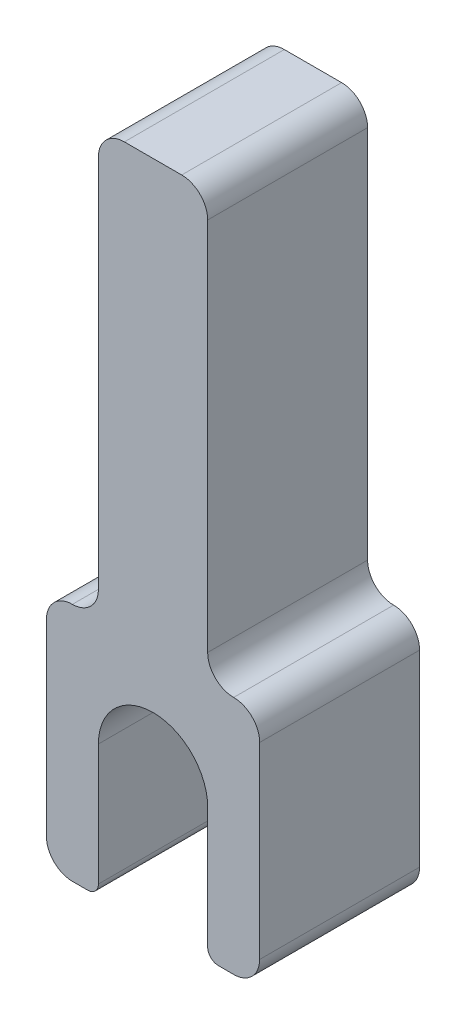
ISO-10303-21;
HEADER;
FILE_DESCRIPTION(('STEP AP214'),'2;1');
FILE_NAME('part.step','',(''),(''),'','','');
FILE_SCHEMA(('AUTOMOTIVE_DESIGN { 1 0 10303 214 1 1 1 1 }'));
ENDSEC;
DATA;
#1=APPLICATION_CONTEXT('core data for automotive mechanical design processes');
#2=APPLICATION_PROTOCOL_DEFINITION('international standard','automotive_design',2000,#1);
#3=PRODUCT_CONTEXT('',#1,'mechanical');
#4=PRODUCT('Part','Part','',(#3));
#5=PRODUCT_RELATED_PRODUCT_CATEGORY('part','',(#4));
#6=PRODUCT_DEFINITION_FORMATION('','',#4);
#7=PRODUCT_DEFINITION_CONTEXT('part definition',#1,'design');
#8=PRODUCT_DEFINITION('design','',#6,#7);
#9=PRODUCT_DEFINITION_SHAPE('','',#8);
#10=(LENGTH_UNIT() NAMED_UNIT(*) SI_UNIT(.MILLI.,.METRE.));
#11=(NAMED_UNIT(*) PLANE_ANGLE_UNIT() SI_UNIT($,.RADIAN.));
#12=(NAMED_UNIT(*) SI_UNIT($,.STERADIAN.) SOLID_ANGLE_UNIT());
#13=UNCERTAINTY_MEASURE_WITH_UNIT(LENGTH_MEASURE(1.E-05),#10,'distance_accuracy_value','');
#14=(GEOMETRIC_REPRESENTATION_CONTEXT(3) GLOBAL_UNCERTAINTY_ASSIGNED_CONTEXT((#13)) GLOBAL_UNIT_ASSIGNED_CONTEXT((#10,
#11,#12)) REPRESENTATION_CONTEXT('',''));
#15=CARTESIAN_POINT('',(0.,0.,0.));
#16=DIRECTION('',(0.,0.,1.));
#17=DIRECTION('',(1.,0.,0.));
#18=AXIS2_PLACEMENT_3D('',#15,#16,#17);
#19=CARTESIAN_POINT('',(-2.05,-4.95,6.));
#20=DIRECTION('',(0.,1.,0.));
#21=DIRECTION('',(0.,0.,1.));
#22=AXIS2_PLACEMENT_3D('',#19,#20,#21);
#23=PLANE('',#22);
#24=DIRECTION('',(1.,0.,0.));
#25=VECTOR('',#24,1.);
#26=CARTESIAN_POINT('',(-2.05,-4.95,0.));
#27=LINE('',#26,#25);
#28=CARTESIAN_POINT('',(-3.025,-4.95,0.));
#29=VERTEX_POINT('',#28);
#30=CARTESIAN_POINT('',(-2.45,-4.95,0.));
#31=VERTEX_POINT('',#30);
#32=EDGE_CURVE('E222',#29,#31,#27,.T.);
#33=ORIENTED_EDGE('',*,*,#32,.T.);
#34=DIRECTION('',(0.,0.,-1.));
#35=VECTOR('',#34,1.);
#36=CARTESIAN_POINT('',(-2.45,-4.95,6.));
#37=LINE('',#36,#35);
#38=CARTESIAN_POINT('',(-2.45,-4.95,6.));
#39=VERTEX_POINT('',#38);
#40=EDGE_CURVE('E11',#31,#39,#37,.F.);
#41=ORIENTED_EDGE('',*,*,#40,.T.);
#42=DIRECTION('',(1.,0.,0.));
#43=VECTOR('',#42,1.);
#44=CARTESIAN_POINT('',(-2.05,-4.95,6.));
#45=LINE('',#44,#43);
#46=CARTESIAN_POINT('',(-3.025,-4.95,6.));
#47=VERTEX_POINT('',#46);
#48=EDGE_CURVE('E185',#47,#39,#45,.T.);
#49=ORIENTED_EDGE('',*,*,#48,.F.);
#50=DIRECTION('',(0.,0.,-1.));
#51=VECTOR('',#50,1.);
#52=CARTESIAN_POINT('',(-3.025,-4.95,6.));
#53=LINE('',#52,#51);
#54=EDGE_CURVE('E194',#47,#29,#53,.T.);
#55=ORIENTED_EDGE('',*,*,#54,.T.);
#56=EDGE_LOOP('',(#33,#41,#49,#55));
#57=FACE_BOUND('',#56,.T.);
#58=ADVANCED_FACE('F41',(#57),#23,.F.);
#59=CARTESIAN_POINT('',(-2.05,0.,6.));
#60=DIRECTION('',(-1.,0.,0.));
#61=DIRECTION('',(0.,0.,1.));
#62=AXIS2_PLACEMENT_3D('',#59,#60,#61);
#63=PLANE('',#62);
#64=DIRECTION('',(0.,1.,0.));
#65=VECTOR('',#64,1.);
#66=CARTESIAN_POINT('',(-2.05,0.,6.));
#67=LINE('',#66,#65);
#68=CARTESIAN_POINT('',(-2.05,-4.55,6.));
#69=VERTEX_POINT('',#68);
#70=CARTESIAN_POINT('',(-2.05,0.,6.));
#71=VERTEX_POINT('',#70);
#72=EDGE_CURVE('E175',#69,#71,#67,.T.);
#73=ORIENTED_EDGE('',*,*,#72,.F.);
#74=DIRECTION('',(0.,0.,-1.));
#75=VECTOR('',#74,1.);
#76=CARTESIAN_POINT('',(-2.05,-4.55,6.));
#77=LINE('',#76,#75);
#78=CARTESIAN_POINT('',(-2.05,-4.55,0.));
#79=VERTEX_POINT('',#78);
#80=EDGE_CURVE('E49',#69,#79,#77,.T.);
#81=ORIENTED_EDGE('',*,*,#80,.T.);
#82=DIRECTION('',(0.,1.,0.));
#83=VECTOR('',#82,1.);
#84=CARTESIAN_POINT('',(-2.05,0.,0.));
#85=LINE('',#84,#83);
#86=CARTESIAN_POINT('',(-2.05,0.,0.));
#87=VERTEX_POINT('',#86);
#88=EDGE_CURVE('E191',#79,#87,#85,.T.);
#89=ORIENTED_EDGE('',*,*,#88,.T.);
#90=DIRECTION('',(0.,0.,-1.));
#91=VECTOR('',#90,1.);
#92=CARTESIAN_POINT('',(-2.05,0.,6.));
#93=LINE('',#92,#91);
#94=EDGE_CURVE('E188',#71,#87,#93,.T.);
#95=ORIENTED_EDGE('',*,*,#94,.F.);
#96=EDGE_LOOP('',(#73,#81,#89,#95));
#97=FACE_BOUND('',#96,.T.);
#98=ADVANCED_FACE('F189',(#97),#63,.F.);
#99=CARTESIAN_POINT('',(0.,0.,6.));
#100=DIRECTION('',(0.,0.,-1.));
#101=DIRECTION('',(-1.,0.,0.));
#102=AXIS2_PLACEMENT_3D('',#99,#100,#101);
#103=CYLINDRICAL_SURFACE('',#102,2.05);
#104=CARTESIAN_POINT('',(0.,0.,0.));
#105=DIRECTION('',(0.,0.,-1.));
#106=DIRECTION('',(1.,0.,0.));
#107=AXIS2_PLACEMENT_3D('',#104,#105,#106);
#108=CIRCLE('',#107,2.05);
#109=CARTESIAN_POINT('',(2.05,0.,0.));
#110=VERTEX_POINT('',#109);
#111=EDGE_CURVE('E226',#87,#110,#108,.T.);
#112=ORIENTED_EDGE('',*,*,#111,.T.);
#113=DIRECTION('',(0.,0.,-1.));
#114=VECTOR('',#113,1.);
#115=CARTESIAN_POINT('',(2.05,0.,6.));
#116=LINE('',#115,#114);
#117=CARTESIAN_POINT('',(2.05,0.,6.));
#118=VERTEX_POINT('',#117);
#119=EDGE_CURVE('E195',#118,#110,#116,.T.);
#120=ORIENTED_EDGE('',*,*,#119,.F.);
#121=CARTESIAN_POINT('',(0.,0.,6.));
#122=DIRECTION('',(0.,0.,-1.));
#123=DIRECTION('',(1.,0.,0.));
#124=AXIS2_PLACEMENT_3D('',#121,#122,#123);
#125=CIRCLE('',#124,2.05);
#126=EDGE_CURVE('E180',#71,#118,#125,.T.);
#127=ORIENTED_EDGE('',*,*,#126,.F.);
#128=ORIENTED_EDGE('',*,*,#94,.T.);
#129=EDGE_LOOP('',(#112,#120,#127,#128));
#130=FACE_BOUND('',#129,.T.);
#131=ADVANCED_FACE('F197',(#130),#103,.F.);
#132=CARTESIAN_POINT('',(2.05,-4.95,6.));
#133=DIRECTION('',(1.,0.,0.));
#134=DIRECTION('',(0.,1.,0.));
#135=AXIS2_PLACEMENT_3D('',#132,#133,#134);
#136=PLANE('',#135);
#137=DIRECTION('',(0.,-1.,0.));
#138=VECTOR('',#137,1.);
#139=CARTESIAN_POINT('',(2.05,-4.95,0.));
#140=LINE('',#139,#138);
#141=CARTESIAN_POINT('',(2.05,-4.55,0.));
#142=VERTEX_POINT('',#141);
#143=EDGE_CURVE('E228',#110,#142,#140,.T.);
#144=ORIENTED_EDGE('',*,*,#143,.T.);
#145=DIRECTION('',(0.,0.,-1.));
#146=VECTOR('',#145,1.);
#147=CARTESIAN_POINT('',(2.05,-4.55,6.));
#148=LINE('',#147,#146);
#149=CARTESIAN_POINT('',(2.05,-4.55,6.));
#150=VERTEX_POINT('',#149);
#151=EDGE_CURVE('E324',#142,#150,#148,.F.);
#152=ORIENTED_EDGE('',*,*,#151,.T.);
#153=DIRECTION('',(0.,-1.,0.));
#154=VECTOR('',#153,1.);
#155=CARTESIAN_POINT('',(2.05,-4.95,6.));
#156=LINE('',#155,#154);
#157=EDGE_CURVE('E200',#118,#150,#156,.T.);
#158=ORIENTED_EDGE('',*,*,#157,.F.);
#159=ORIENTED_EDGE('',*,*,#119,.T.);
#160=EDGE_LOOP('',(#144,#152,#158,#159));
#161=FACE_BOUND('',#160,.T.);
#162=ADVANCED_FACE('F335',(#161),#136,.F.);
#163=CARTESIAN_POINT('',(4.,-4.95,6.));
#164=DIRECTION('',(0.,1.,0.));
#165=DIRECTION('',(0.,0.,1.));
#166=AXIS2_PLACEMENT_3D('',#163,#164,#165);
#167=PLANE('',#166);
#168=DIRECTION('',(1.,0.,0.));
#169=VECTOR('',#168,1.);
#170=CARTESIAN_POINT('',(4.,-4.95,6.));
#171=LINE('',#170,#169);
#172=CARTESIAN_POINT('',(2.45,-4.95,6.));
#173=VERTEX_POINT('',#172);
#174=CARTESIAN_POINT('',(3.025,-4.95,6.));
#175=VERTEX_POINT('',#174);
#176=EDGE_CURVE('E202',#173,#175,#171,.T.);
#177=ORIENTED_EDGE('',*,*,#176,.F.);
#178=DIRECTION('',(0.,0.,-1.));
#179=VECTOR('',#178,1.);
#180=CARTESIAN_POINT('',(2.45,-4.95,6.));
#181=LINE('',#180,#179);
#182=CARTESIAN_POINT('',(2.45,-4.95,0.));
#183=VERTEX_POINT('',#182);
#184=EDGE_CURVE('E312',#173,#183,#181,.T.);
#185=ORIENTED_EDGE('',*,*,#184,.T.);
#186=DIRECTION('',(1.,0.,0.));
#187=VECTOR('',#186,1.);
#188=CARTESIAN_POINT('',(4.,-4.95,0.));
#189=LINE('',#188,#187);
#190=CARTESIAN_POINT('',(3.025,-4.95,0.));
#191=VERTEX_POINT('',#190);
#192=EDGE_CURVE('E231',#183,#191,#189,.T.);
#193=ORIENTED_EDGE('',*,*,#192,.T.);
#194=DIRECTION('',(0.,0.,-1.));
#195=VECTOR('',#194,1.);
#196=CARTESIAN_POINT('',(3.025,-4.95,6.));
#197=LINE('',#196,#195);
#198=EDGE_CURVE('E292',#191,#175,#197,.F.);
#199=ORIENTED_EDGE('',*,*,#198,.T.);
#200=EDGE_LOOP('',(#177,#185,#193,#199));
#201=FACE_BOUND('',#200,.T.);
#202=ADVANCED_FACE('F343',(#201),#167,.F.);
#203=CARTESIAN_POINT('',(4.,4.05,6.));
#204=DIRECTION('',(-1.,0.,0.));
#205=DIRECTION('',(0.,0.,1.));
#206=AXIS2_PLACEMENT_3D('',#203,#204,#205);
#207=PLANE('',#206);
#208=DIRECTION('',(0.,1.,0.));
#209=VECTOR('',#208,1.);
#210=CARTESIAN_POINT('',(4.,4.05,0.));
#211=LINE('',#210,#209);
#212=CARTESIAN_POINT('',(4.,-3.975,0.));
#213=VERTEX_POINT('',#212);
#214=CARTESIAN_POINT('',(4.,3.075,0.));
#215=VERTEX_POINT('',#214);
#216=EDGE_CURVE('E233',#213,#215,#211,.T.);
#217=ORIENTED_EDGE('',*,*,#216,.T.);
#218=DIRECTION('',(0.,0.,-1.));
#219=VECTOR('',#218,1.);
#220=CARTESIAN_POINT('',(4.,3.075,6.));
#221=LINE('',#220,#219);
#222=CARTESIAN_POINT('',(4.,3.075,6.));
#223=VERTEX_POINT('',#222);
#224=EDGE_CURVE('E289',#215,#223,#221,.F.);
#225=ORIENTED_EDGE('',*,*,#224,.T.);
#226=DIRECTION('',(0.,1.,0.));
#227=VECTOR('',#226,1.);
#228=CARTESIAN_POINT('',(4.,4.05,6.));
#229=LINE('',#228,#227);
#230=CARTESIAN_POINT('',(4.,-3.975,6.));
#231=VERTEX_POINT('',#230);
#232=EDGE_CURVE('E207',#231,#223,#229,.T.);
#233=ORIENTED_EDGE('',*,*,#232,.F.);
#234=DIRECTION('',(0.,0.,-1.));
#235=VECTOR('',#234,1.);
#236=CARTESIAN_POINT('',(4.,-3.975,6.));
#237=LINE('',#236,#235);
#238=EDGE_CURVE('E286',#231,#213,#237,.T.);
#239=ORIENTED_EDGE('',*,*,#238,.T.);
#240=EDGE_LOOP('',(#217,#225,#233,#239));
#241=FACE_BOUND('',#240,.T.);
#242=ADVANCED_FACE('F352',(#241),#207,.F.);
#243=CARTESIAN_POINT('',(2.05,20.05,6.));
#244=DIRECTION('',(-1.,0.,0.));
#245=DIRECTION('',(0.,-1.,0.));
#246=AXIS2_PLACEMENT_3D('',#243,#244,#245);
#247=PLANE('',#246);
#248=DIRECTION('',(0.,1.,0.));
#249=VECTOR('',#248,1.);
#250=CARTESIAN_POINT('',(2.05,20.05,6.));
#251=LINE('',#250,#249);
#252=CARTESIAN_POINT('',(2.05,5.025,6.));
#253=VERTEX_POINT('',#252);
#254=CARTESIAN_POINT('',(2.05,19.075,6.));
#255=VERTEX_POINT('',#254);
#256=EDGE_CURVE('E210',#253,#255,#251,.T.);
#257=ORIENTED_EDGE('',*,*,#256,.F.);
#258=DIRECTION('',(0.,0.,-1.));
#259=VECTOR('',#258,1.);
#260=CARTESIAN_POINT('',(2.05,5.025,0.));
#261=LINE('',#260,#259);
#262=CARTESIAN_POINT('',(2.05,5.025,0.));
#263=VERTEX_POINT('',#262);
#264=EDGE_CURVE('E297',#253,#263,#261,.T.);
#265=ORIENTED_EDGE('',*,*,#264,.T.);
#266=DIRECTION('',(0.,1.,0.));
#267=VECTOR('',#266,1.);
#268=CARTESIAN_POINT('',(2.05,20.05,0.));
#269=LINE('',#268,#267);
#270=CARTESIAN_POINT('',(2.05,19.075,0.));
#271=VERTEX_POINT('',#270);
#272=EDGE_CURVE('E236',#263,#271,#269,.T.);
#273=ORIENTED_EDGE('',*,*,#272,.T.);
#274=DIRECTION('',(0.,0.,-1.));
#275=VECTOR('',#274,1.);
#276=CARTESIAN_POINT('',(2.05,19.075,6.));
#277=LINE('',#276,#275);
#278=EDGE_CURVE('E295',#271,#255,#277,.F.);
#279=ORIENTED_EDGE('',*,*,#278,.T.);
#280=EDGE_LOOP('',(#257,#265,#273,#279));
#281=FACE_BOUND('',#280,.T.);
#282=ADVANCED_FACE('F366',(#281),#247,.F.);
#283=CARTESIAN_POINT('',(-2.05,20.05,6.));
#284=DIRECTION('',(0.,-1.,0.));
#285=DIRECTION('',(1.,0.,0.));
#286=AXIS2_PLACEMENT_3D('',#283,#284,#285);
#287=PLANE('',#286);
#288=DIRECTION('',(-1.,0.,0.));
#289=VECTOR('',#288,1.);
#290=CARTESIAN_POINT('',(-2.05,20.05,0.));
#291=LINE('',#290,#289);
#292=CARTESIAN_POINT('',(1.075,20.05,0.));
#293=VERTEX_POINT('',#292);
#294=CARTESIAN_POINT('',(-1.075,20.05,0.));
#295=VERTEX_POINT('',#294);
#296=EDGE_CURVE('E239',#293,#295,#291,.T.);
#297=ORIENTED_EDGE('',*,*,#296,.T.);
#298=DIRECTION('',(0.,0.,-1.));
#299=VECTOR('',#298,1.);
#300=CARTESIAN_POINT('',(-1.075,20.05,6.));
#301=LINE('',#300,#299);
#302=CARTESIAN_POINT('',(-1.075,20.05,6.));
#303=VERTEX_POINT('',#302);
#304=EDGE_CURVE('E302',#295,#303,#301,.F.);
#305=ORIENTED_EDGE('',*,*,#304,.T.);
#306=DIRECTION('',(-1.,0.,0.));
#307=VECTOR('',#306,1.);
#308=CARTESIAN_POINT('',(-2.05,20.05,6.));
#309=LINE('',#308,#307);
#310=CARTESIAN_POINT('',(1.075,20.05,6.));
#311=VERTEX_POINT('',#310);
#312=EDGE_CURVE('E213',#311,#303,#309,.T.);
#313=ORIENTED_EDGE('',*,*,#312,.F.);
#314=DIRECTION('',(0.,0.,-1.));
#315=VECTOR('',#314,1.);
#316=CARTESIAN_POINT('',(1.075,20.05,6.));
#317=LINE('',#316,#315);
#318=EDGE_CURVE('E299',#311,#293,#317,.T.);
#319=ORIENTED_EDGE('',*,*,#318,.T.);
#320=EDGE_LOOP('',(#297,#305,#313,#319));
#321=FACE_BOUND('',#320,.T.);
#322=ADVANCED_FACE('F375',(#321),#287,.F.);
#323=CARTESIAN_POINT('',(-2.05,4.05,6.));
#324=DIRECTION('',(1.,0.,0.));
#325=DIRECTION('',(0.,1.,0.));
#326=AXIS2_PLACEMENT_3D('',#323,#324,#325);
#327=PLANE('',#326);
#328=DIRECTION('',(0.,-1.,0.));
#329=VECTOR('',#328,1.);
#330=CARTESIAN_POINT('',(-2.05,4.05,0.));
#331=LINE('',#330,#329);
#332=CARTESIAN_POINT('',(-2.05,19.075,0.));
#333=VERTEX_POINT('',#332);
#334=CARTESIAN_POINT('',(-2.05,5.025,0.));
#335=VERTEX_POINT('',#334);
#336=EDGE_CURVE('E242',#333,#335,#331,.T.);
#337=ORIENTED_EDGE('',*,*,#336,.T.);
#338=DIRECTION('',(0.,0.,-1.));
#339=VECTOR('',#338,1.);
#340=CARTESIAN_POINT('',(-2.05,5.025,6.));
#341=LINE('',#340,#339);
#342=CARTESIAN_POINT('',(-2.05,5.025,6.));
#343=VERTEX_POINT('',#342);
#344=EDGE_CURVE('E284',#335,#343,#341,.F.);
#345=ORIENTED_EDGE('',*,*,#344,.T.);
#346=DIRECTION('',(0.,-1.,0.));
#347=VECTOR('',#346,1.);
#348=CARTESIAN_POINT('',(-2.05,4.05,6.));
#349=LINE('',#348,#347);
#350=CARTESIAN_POINT('',(-2.05,19.075,6.));
#351=VERTEX_POINT('',#350);
#352=EDGE_CURVE('E216',#351,#343,#349,.T.);
#353=ORIENTED_EDGE('',*,*,#352,.F.);
#354=DIRECTION('',(0.,0.,-1.));
#355=VECTOR('',#354,1.);
#356=CARTESIAN_POINT('',(-2.05,19.075,6.));
#357=LINE('',#356,#355);
#358=EDGE_CURVE('E281',#351,#333,#357,.T.);
#359=ORIENTED_EDGE('',*,*,#358,.T.);
#360=EDGE_LOOP('',(#337,#345,#353,#359));
#361=FACE_BOUND('',#360,.T.);
#362=ADVANCED_FACE('F384',(#361),#327,.F.);
#363=CARTESIAN_POINT('',(-4.,-4.95,6.));
#364=DIRECTION('',(1.,0.,0.));
#365=DIRECTION('',(0.,0.,-1.));
#366=AXIS2_PLACEMENT_3D('',#363,#364,#365);
#367=PLANE('',#366);
#368=DIRECTION('',(0.,-1.,0.));
#369=VECTOR('',#368,1.);
#370=CARTESIAN_POINT('',(-4.,-4.95,0.));
#371=LINE('',#370,#369);
#372=CARTESIAN_POINT('',(-4.,3.075,0.));
#373=VERTEX_POINT('',#372);
#374=CARTESIAN_POINT('',(-4.,-3.975,0.));
#375=VERTEX_POINT('',#374);
#376=EDGE_CURVE('E245',#373,#375,#371,.T.);
#377=ORIENTED_EDGE('',*,*,#376,.T.);
#378=DIRECTION('',(0.,0.,-1.));
#379=VECTOR('',#378,1.);
#380=CARTESIAN_POINT('',(-4.,-3.975,6.));
#381=LINE('',#380,#379);
#382=CARTESIAN_POINT('',(-4.,-3.975,6.));
#383=VERTEX_POINT('',#382);
#384=EDGE_CURVE('E267',#375,#383,#381,.F.);
#385=ORIENTED_EDGE('',*,*,#384,.T.);
#386=DIRECTION('',(0.,-1.,0.));
#387=VECTOR('',#386,1.);
#388=CARTESIAN_POINT('',(-4.,-4.95,6.));
#389=LINE('',#388,#387);
#390=CARTESIAN_POINT('',(-4.,3.075,6.));
#391=VERTEX_POINT('',#390);
#392=EDGE_CURVE('E219',#391,#383,#389,.T.);
#393=ORIENTED_EDGE('',*,*,#392,.F.);
#394=DIRECTION('',(0.,0.,-1.));
#395=VECTOR('',#394,1.);
#396=CARTESIAN_POINT('',(-4.,3.075,6.));
#397=LINE('',#396,#395);
#398=EDGE_CURVE('E264',#391,#373,#397,.T.);
#399=ORIENTED_EDGE('',*,*,#398,.T.);
#400=EDGE_LOOP('',(#377,#385,#393,#399));
#401=FACE_BOUND('',#400,.T.);
#402=ADVANCED_FACE('F399',(#401),#367,.F.);
#403=CARTESIAN_POINT('',(0.,0.,6.));
#404=DIRECTION('',(0.,0.,1.));
#405=DIRECTION('',(1.,0.,0.));
#406=AXIS2_PLACEMENT_3D('',#403,#404,#405);
#407=PLANE('',#406);
#408=ORIENTED_EDGE('',*,*,#157,.T.);
#409=CARTESIAN_POINT('',(2.45,-4.55,6.));
#410=DIRECTION('',(0.,0.,1.));
#411=DIRECTION('',(1.,0.,0.));
#412=AXIS2_PLACEMENT_3D('',#409,#410,#411);
#413=CIRCLE('',#412,0.4);
#414=EDGE_CURVE('E327',#150,#173,#413,.T.);
#415=ORIENTED_EDGE('',*,*,#414,.T.);
#416=ORIENTED_EDGE('',*,*,#176,.T.);
#417=CARTESIAN_POINT('',(3.025,-3.975,6.));
#418=DIRECTION('',(0.,0.,1.));
#419=DIRECTION('',(1.,0.,0.));
#420=AXIS2_PLACEMENT_3D('',#417,#418,#419);
#421=CIRCLE('',#420,0.975);
#422=EDGE_CURVE('E273',#175,#231,#421,.T.);
#423=ORIENTED_EDGE('',*,*,#422,.T.);
#424=ORIENTED_EDGE('',*,*,#232,.T.);
#425=CARTESIAN_POINT('',(3.025,3.075,6.));
#426=DIRECTION('',(0.,0.,1.));
#427=DIRECTION('',(1.,0.,0.));
#428=AXIS2_PLACEMENT_3D('',#425,#426,#427);
#429=CIRCLE('',#428,0.975);
#430=CARTESIAN_POINT('',(3.025,4.05,6.));
#431=VERTEX_POINT('',#430);
#432=EDGE_CURVE('E275',#223,#431,#429,.T.);
#433=ORIENTED_EDGE('',*,*,#432,.T.);
#434=CARTESIAN_POINT('',(3.025,5.025,6.));
#435=DIRECTION('',(0.,0.,1.));
#436=DIRECTION('',(1.,0.,0.));
#437=AXIS2_PLACEMENT_3D('',#434,#435,#436);
#438=CIRCLE('',#437,0.975);
#439=EDGE_CURVE('E310',#431,#253,#438,.F.);
#440=ORIENTED_EDGE('',*,*,#439,.T.);
#441=ORIENTED_EDGE('',*,*,#256,.T.);
#442=CARTESIAN_POINT('',(1.075,19.075,6.));
#443=DIRECTION('',(0.,0.,1.));
#444=DIRECTION('',(1.,0.,0.));
#445=AXIS2_PLACEMENT_3D('',#442,#443,#444);
#446=CIRCLE('',#445,0.975);
#447=EDGE_CURVE('E269',#255,#311,#446,.T.);
#448=ORIENTED_EDGE('',*,*,#447,.T.);
#449=ORIENTED_EDGE('',*,*,#312,.T.);
#450=CARTESIAN_POINT('',(-1.075,19.075,6.));
#451=DIRECTION('',(0.,0.,1.));
#452=DIRECTION('',(1.,0.,0.));
#453=AXIS2_PLACEMENT_3D('',#450,#451,#452);
#454=CIRCLE('',#453,0.975);
#455=EDGE_CURVE('E271',#303,#351,#454,.T.);
#456=ORIENTED_EDGE('',*,*,#455,.T.);
#457=ORIENTED_EDGE('',*,*,#352,.T.);
#458=CARTESIAN_POINT('',(-3.025,5.025,6.));
#459=DIRECTION('',(0.,0.,1.));
#460=DIRECTION('',(1.,0.,0.));
#461=AXIS2_PLACEMENT_3D('',#458,#459,#460);
#462=CIRCLE('',#461,0.975);
#463=CARTESIAN_POINT('',(-3.025,4.05,6.));
#464=VERTEX_POINT('',#463);
#465=EDGE_CURVE('E306',#343,#464,#462,.F.);
#466=ORIENTED_EDGE('',*,*,#465,.T.);
#467=CARTESIAN_POINT('',(-3.025,3.075,6.));
#468=DIRECTION('',(0.,0.,1.));
#469=DIRECTION('',(1.,0.,0.));
#470=AXIS2_PLACEMENT_3D('',#467,#468,#469);
#471=CIRCLE('',#470,0.975);
#472=EDGE_CURVE('E277',#464,#391,#471,.T.);
#473=ORIENTED_EDGE('',*,*,#472,.T.);
#474=ORIENTED_EDGE('',*,*,#392,.T.);
#475=CARTESIAN_POINT('',(-3.025,-3.975,6.));
#476=DIRECTION('',(0.,0.,1.));
#477=DIRECTION('',(1.,0.,0.));
#478=AXIS2_PLACEMENT_3D('',#475,#476,#477);
#479=CIRCLE('',#478,0.975);
#480=EDGE_CURVE('E279',#383,#47,#479,.T.);
#481=ORIENTED_EDGE('',*,*,#480,.T.);
#482=ORIENTED_EDGE('',*,*,#48,.T.);
#483=CARTESIAN_POINT('',(-2.45,-4.55,6.));
#484=DIRECTION('',(0.,0.,1.));
#485=DIRECTION('',(1.,0.,0.));
#486=AXIS2_PLACEMENT_3D('',#483,#484,#485);
#487=CIRCLE('',#486,0.4);
#488=EDGE_CURVE('E56',#39,#69,#487,.T.);
#489=ORIENTED_EDGE('',*,*,#488,.T.);
#490=ORIENTED_EDGE('',*,*,#72,.T.);
#491=ORIENTED_EDGE('',*,*,#126,.T.);
#492=EDGE_LOOP('',(#408,#415,#416,#423,#424,#433,#440,#441,#448,#449,#456,#457,#466,#473,#474,
#481,#482,#489,#490,#491));
#493=FACE_BOUND('',#492,.T.);
#494=ADVANCED_FACE('F178',(#493),#407,.T.);
#495=CARTESIAN_POINT('',(0.,0.,0.));
#496=DIRECTION('',(0.,0.,1.));
#497=DIRECTION('',(1.,0.,0.));
#498=AXIS2_PLACEMENT_3D('',#495,#496,#497);
#499=PLANE('',#498);
#500=ORIENTED_EDGE('',*,*,#192,.F.);
#501=CARTESIAN_POINT('',(2.45,-4.55,0.));
#502=DIRECTION('',(0.,0.,1.));
#503=DIRECTION('',(1.,0.,0.));
#504=AXIS2_PLACEMENT_3D('',#501,#502,#503);
#505=CIRCLE('',#504,0.4);
#506=EDGE_CURVE('E322',#183,#142,#505,.F.);
#507=ORIENTED_EDGE('',*,*,#506,.T.);
#508=ORIENTED_EDGE('',*,*,#143,.F.);
#509=ORIENTED_EDGE('',*,*,#111,.F.);
#510=ORIENTED_EDGE('',*,*,#88,.F.);
#511=CARTESIAN_POINT('',(-2.45,-4.55,0.));
#512=DIRECTION('',(0.,0.,1.));
#513=DIRECTION('',(1.,0.,0.));
#514=AXIS2_PLACEMENT_3D('',#511,#512,#513);
#515=CIRCLE('',#514,0.4);
#516=EDGE_CURVE('E320',#79,#31,#515,.F.);
#517=ORIENTED_EDGE('',*,*,#516,.T.);
#518=ORIENTED_EDGE('',*,*,#32,.F.);
#519=CARTESIAN_POINT('',(-3.025,-3.975,0.));
#520=DIRECTION('',(0.,0.,1.));
#521=DIRECTION('',(1.,0.,0.));
#522=AXIS2_PLACEMENT_3D('',#519,#520,#521);
#523=CIRCLE('',#522,0.975);
#524=EDGE_CURVE('E262',#29,#375,#523,.F.);
#525=ORIENTED_EDGE('',*,*,#524,.T.);
#526=ORIENTED_EDGE('',*,*,#376,.F.);
#527=CARTESIAN_POINT('',(-3.025,3.075,0.));
#528=DIRECTION('',(0.,0.,1.));
#529=DIRECTION('',(1.,0.,0.));
#530=AXIS2_PLACEMENT_3D('',#527,#528,#529);
#531=CIRCLE('',#530,0.975);
#532=CARTESIAN_POINT('',(-3.025,4.05,0.));
#533=VERTEX_POINT('',#532);
#534=EDGE_CURVE('E260',#373,#533,#531,.F.);
#535=ORIENTED_EDGE('',*,*,#534,.T.);
#536=CARTESIAN_POINT('',(-3.025,5.025,0.));
#537=DIRECTION('',(0.,0.,1.));
#538=DIRECTION('',(1.,0.,0.));
#539=AXIS2_PLACEMENT_3D('',#536,#537,#538);
#540=CIRCLE('',#539,0.975);
#541=EDGE_CURVE('E304',#533,#335,#540,.T.);
#542=ORIENTED_EDGE('',*,*,#541,.T.);
#543=ORIENTED_EDGE('',*,*,#336,.F.);
#544=CARTESIAN_POINT('',(-1.075,19.075,0.));
#545=DIRECTION('',(0.,0.,1.));
#546=DIRECTION('',(1.,0.,0.));
#547=AXIS2_PLACEMENT_3D('',#544,#545,#546);
#548=CIRCLE('',#547,0.975);
#549=EDGE_CURVE('E253',#333,#295,#548,.F.);
#550=ORIENTED_EDGE('',*,*,#549,.T.);
#551=ORIENTED_EDGE('',*,*,#296,.F.);
#552=CARTESIAN_POINT('',(1.075,19.075,0.));
#553=DIRECTION('',(0.,0.,1.));
#554=DIRECTION('',(1.,0.,0.));
#555=AXIS2_PLACEMENT_3D('',#552,#553,#554);
#556=CIRCLE('',#555,0.975);
#557=EDGE_CURVE('E251',#293,#271,#556,.F.);
#558=ORIENTED_EDGE('',*,*,#557,.T.);
#559=ORIENTED_EDGE('',*,*,#272,.F.);
#560=CARTESIAN_POINT('',(3.025,5.025,0.));
#561=DIRECTION('',(0.,0.,1.));
#562=DIRECTION('',(1.,0.,0.));
#563=AXIS2_PLACEMENT_3D('',#560,#561,#562);
#564=CIRCLE('',#563,0.975);
#565=CARTESIAN_POINT('',(3.025,4.05,0.));
#566=VERTEX_POINT('',#565);
#567=EDGE_CURVE('E308',#263,#566,#564,.T.);
#568=ORIENTED_EDGE('',*,*,#567,.T.);
#569=CARTESIAN_POINT('',(3.025,3.075,0.));
#570=DIRECTION('',(0.,0.,1.));
#571=DIRECTION('',(1.,0.,0.));
#572=AXIS2_PLACEMENT_3D('',#569,#570,#571);
#573=CIRCLE('',#572,0.975);
#574=EDGE_CURVE('E258',#566,#215,#573,.F.);
#575=ORIENTED_EDGE('',*,*,#574,.T.);
#576=ORIENTED_EDGE('',*,*,#216,.F.);
#577=CARTESIAN_POINT('',(3.025,-3.975,0.));
#578=DIRECTION('',(0.,0.,1.));
#579=DIRECTION('',(1.,0.,0.));
#580=AXIS2_PLACEMENT_3D('',#577,#578,#579);
#581=CIRCLE('',#580,0.975);
#582=EDGE_CURVE('E255',#213,#191,#581,.F.);
#583=ORIENTED_EDGE('',*,*,#582,.T.);
#584=EDGE_LOOP('',(#500,#507,#508,#509,#510,#517,#518,#525,#526,#535,#542,#543,#550,#551,#558,
#559,#568,#575,#576,#583));
#585=FACE_BOUND('',#584,.T.);
#586=ADVANCED_FACE('F331',(#585),#499,.F.);
#587=CARTESIAN_POINT('',(-3.025,-3.975,6.));
#588=DIRECTION('',(0.,0.,-1.));
#589=DIRECTION('',(-1.,0.,0.));
#590=AXIS2_PLACEMENT_3D('',#587,#588,#589);
#591=CYLINDRICAL_SURFACE('',#590,0.975);
#592=ORIENTED_EDGE('',*,*,#480,.F.);
#593=ORIENTED_EDGE('',*,*,#384,.F.);
#594=ORIENTED_EDGE('',*,*,#524,.F.);
#595=ORIENTED_EDGE('',*,*,#54,.F.);
#596=EDGE_LOOP('',(#592,#593,#594,#595));
#597=FACE_BOUND('',#596,.T.);
#598=ADVANCED_FACE('F402',(#597),#591,.T.);
#599=CARTESIAN_POINT('',(-3.025,5.025,6.));
#600=DIRECTION('',(0.,0.,1.));
#601=DIRECTION('',(1.,0.,0.));
#602=AXIS2_PLACEMENT_3D('',#599,#600,#601);
#603=CYLINDRICAL_SURFACE('',#602,0.975);
#604=DIRECTION('',(0.,0.,-1.));
#605=VECTOR('',#604,1.);
#606=CARTESIAN_POINT('',(-3.025,4.05,0.));
#607=LINE('',#606,#605);
#608=EDGE_CURVE('E224',#464,#533,#607,.T.);
#609=ORIENTED_EDGE('',*,*,#608,.F.);
#610=ORIENTED_EDGE('',*,*,#465,.F.);
#611=ORIENTED_EDGE('',*,*,#344,.F.);
#612=ORIENTED_EDGE('',*,*,#541,.F.);
#613=EDGE_LOOP('',(#609,#610,#611,#612));
#614=FACE_BOUND('',#613,.T.);
#615=ADVANCED_FACE('F390',(#614),#603,.F.);
#616=CARTESIAN_POINT('',(-3.025,3.075,6.));
#617=DIRECTION('',(0.,0.,-1.));
#618=DIRECTION('',(-1.,0.,0.));
#619=AXIS2_PLACEMENT_3D('',#616,#617,#618);
#620=CYLINDRICAL_SURFACE('',#619,0.975);
#621=ORIENTED_EDGE('',*,*,#472,.F.);
#622=ORIENTED_EDGE('',*,*,#608,.T.);
#623=ORIENTED_EDGE('',*,*,#534,.F.);
#624=ORIENTED_EDGE('',*,*,#398,.F.);
#625=EDGE_LOOP('',(#621,#622,#623,#624));
#626=FACE_BOUND('',#625,.T.);
#627=ADVANCED_FACE('F394',(#626),#620,.T.);
#628=CARTESIAN_POINT('',(3.025,5.025,6.));
#629=DIRECTION('',(0.,0.,1.));
#630=DIRECTION('',(1.,0.,0.));
#631=AXIS2_PLACEMENT_3D('',#628,#629,#630);
#632=CYLINDRICAL_SURFACE('',#631,0.975);
#633=ORIENTED_EDGE('',*,*,#264,.F.);
#634=ORIENTED_EDGE('',*,*,#439,.F.);
#635=DIRECTION('',(0.,0.,-1.));
#636=VECTOR('',#635,1.);
#637=CARTESIAN_POINT('',(3.025,4.05,6.));
#638=LINE('',#637,#636);
#639=EDGE_CURVE('E315',#566,#431,#638,.F.);
#640=ORIENTED_EDGE('',*,*,#639,.F.);
#641=ORIENTED_EDGE('',*,*,#567,.F.);
#642=EDGE_LOOP('',(#633,#634,#640,#641));
#643=FACE_BOUND('',#642,.T.);
#644=ADVANCED_FACE('F362',(#643),#632,.F.);
#645=CARTESIAN_POINT('',(3.025,3.075,6.));
#646=DIRECTION('',(0.,0.,-1.));
#647=DIRECTION('',(-1.,0.,0.));
#648=AXIS2_PLACEMENT_3D('',#645,#646,#647);
#649=CYLINDRICAL_SURFACE('',#648,0.975);
#650=ORIENTED_EDGE('',*,*,#432,.F.);
#651=ORIENTED_EDGE('',*,*,#224,.F.);
#652=ORIENTED_EDGE('',*,*,#574,.F.);
#653=ORIENTED_EDGE('',*,*,#639,.T.);
#654=EDGE_LOOP('',(#650,#651,#652,#653));
#655=FACE_BOUND('',#654,.T.);
#656=ADVANCED_FACE('F356',(#655),#649,.T.);
#657=CARTESIAN_POINT('',(3.025,-3.975,6.));
#658=DIRECTION('',(0.,0.,-1.));
#659=DIRECTION('',(-1.,0.,0.));
#660=AXIS2_PLACEMENT_3D('',#657,#658,#659);
#661=CYLINDRICAL_SURFACE('',#660,0.975);
#662=ORIENTED_EDGE('',*,*,#422,.F.);
#663=ORIENTED_EDGE('',*,*,#198,.F.);
#664=ORIENTED_EDGE('',*,*,#582,.F.);
#665=ORIENTED_EDGE('',*,*,#238,.F.);
#666=EDGE_LOOP('',(#662,#663,#664,#665));
#667=FACE_BOUND('',#666,.T.);
#668=ADVANCED_FACE('F349',(#667),#661,.T.);
#669=CARTESIAN_POINT('',(-1.075,19.075,6.));
#670=DIRECTION('',(0.,0.,-1.));
#671=DIRECTION('',(-1.,0.,0.));
#672=AXIS2_PLACEMENT_3D('',#669,#670,#671);
#673=CYLINDRICAL_SURFACE('',#672,0.975);
#674=ORIENTED_EDGE('',*,*,#455,.F.);
#675=ORIENTED_EDGE('',*,*,#304,.F.);
#676=ORIENTED_EDGE('',*,*,#549,.F.);
#677=ORIENTED_EDGE('',*,*,#358,.F.);
#678=EDGE_LOOP('',(#674,#675,#676,#677));
#679=FACE_BOUND('',#678,.T.);
#680=ADVANCED_FACE('F381',(#679),#673,.T.);
#681=CARTESIAN_POINT('',(1.075,19.075,6.));
#682=DIRECTION('',(0.,0.,-1.));
#683=DIRECTION('',(-1.,0.,0.));
#684=AXIS2_PLACEMENT_3D('',#681,#682,#683);
#685=CYLINDRICAL_SURFACE('',#684,0.975);
#686=ORIENTED_EDGE('',*,*,#447,.F.);
#687=ORIENTED_EDGE('',*,*,#278,.F.);
#688=ORIENTED_EDGE('',*,*,#557,.F.);
#689=ORIENTED_EDGE('',*,*,#318,.F.);
#690=EDGE_LOOP('',(#686,#687,#688,#689));
#691=FACE_BOUND('',#690,.T.);
#692=ADVANCED_FACE('F372',(#691),#685,.T.);
#693=CARTESIAN_POINT('',(2.45,-4.55,6.));
#694=DIRECTION('',(0.,0.,-1.));
#695=DIRECTION('',(-1.,0.,0.));
#696=AXIS2_PLACEMENT_3D('',#693,#694,#695);
#697=CYLINDRICAL_SURFACE('',#696,0.4);
#698=ORIENTED_EDGE('',*,*,#414,.F.);
#699=ORIENTED_EDGE('',*,*,#151,.F.);
#700=ORIENTED_EDGE('',*,*,#506,.F.);
#701=ORIENTED_EDGE('',*,*,#184,.F.);
#702=EDGE_LOOP('',(#698,#699,#700,#701));
#703=FACE_BOUND('',#702,.T.);
#704=ADVANCED_FACE('F341',(#703),#697,.T.);
#705=CARTESIAN_POINT('',(-2.45,-4.55,6.));
#706=DIRECTION('',(0.,0.,-1.));
#707=DIRECTION('',(-1.,0.,0.));
#708=AXIS2_PLACEMENT_3D('',#705,#706,#707);
#709=CYLINDRICAL_SURFACE('',#708,0.4);
#710=ORIENTED_EDGE('',*,*,#488,.F.);
#711=ORIENTED_EDGE('',*,*,#40,.F.);
#712=ORIENTED_EDGE('',*,*,#516,.F.);
#713=ORIENTED_EDGE('',*,*,#80,.F.);
#714=EDGE_LOOP('',(#710,#711,#712,#713));
#715=FACE_BOUND('',#714,.T.);
#716=ADVANCED_FACE('F43',(#715),#709,.T.);
#717=CLOSED_SHELL('',(#58,#98,#131,#162,#202,#242,#282,#322,#362,#402,#494,#586,#598,#615,#627,
#644,#656,#668,#680,#692,#704,#716));
#718=MANIFOLD_SOLID_BREP('B2',#717);
#719=ADVANCED_BREP_SHAPE_REPRESENTATION('',(#18,#718),#14);
#720=SHAPE_DEFINITION_REPRESENTATION(#9,#719);
ENDSEC;
END-ISO-10303-21;
